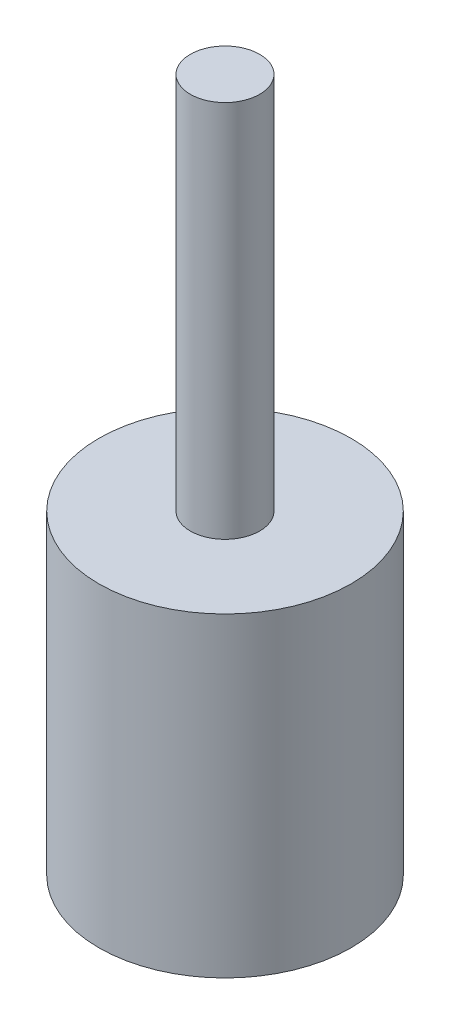
ISO-10303-21;
HEADER;
FILE_DESCRIPTION(('STEP AP214'),'2;1');
FILE_NAME('part.step','',(''),(''),'','','');
FILE_SCHEMA(('AUTOMOTIVE_DESIGN { 1 0 10303 214 1 1 1 1 }'));
ENDSEC;
DATA;
#1=APPLICATION_CONTEXT('core data for automotive mechanical design processes');
#2=APPLICATION_PROTOCOL_DEFINITION('international standard','automotive_design',2000,#1);
#3=PRODUCT_CONTEXT('',#1,'mechanical');
#4=PRODUCT('Part','Part','',(#3));
#5=PRODUCT_RELATED_PRODUCT_CATEGORY('part','',(#4));
#6=PRODUCT_DEFINITION_FORMATION('','',#4);
#7=PRODUCT_DEFINITION_CONTEXT('part definition',#1,'design');
#8=PRODUCT_DEFINITION('design','',#6,#7);
#9=PRODUCT_DEFINITION_SHAPE('','',#8);
#10=(LENGTH_UNIT() NAMED_UNIT(*) SI_UNIT(.MILLI.,.METRE.));
#11=(NAMED_UNIT(*) PLANE_ANGLE_UNIT() SI_UNIT($,.RADIAN.));
#12=(NAMED_UNIT(*) SI_UNIT($,.STERADIAN.) SOLID_ANGLE_UNIT());
#13=UNCERTAINTY_MEASURE_WITH_UNIT(LENGTH_MEASURE(1.E-05),#10,'distance_accuracy_value','');
#14=(GEOMETRIC_REPRESENTATION_CONTEXT(3) GLOBAL_UNCERTAINTY_ASSIGNED_CONTEXT((#13)) GLOBAL_UNIT_ASSIGNED_CONTEXT((#10,
#11,#12)) REPRESENTATION_CONTEXT('',''));
#15=CARTESIAN_POINT('',(0.,0.,0.));
#16=DIRECTION('',(0.,0.,1.));
#17=DIRECTION('',(1.,0.,0.));
#18=AXIS2_PLACEMENT_3D('',#15,#16,#17);
#19=CARTESIAN_POINT('',(0.,100.,0.));
#20=DIRECTION('',(0.,1.,0.));
#21=DIRECTION('',(0.,0.,1.00000000000001));
#22=AXIS2_PLACEMENT_3D('',#19,#20,#21);
#23=PLANE('',#22);
#24=CARTESIAN_POINT('',(0.,100.,0.));
#25=DIRECTION('',(0.,1.,0.));
#26=DIRECTION('',(0.,0.,1.00000000000001));
#27=AXIS2_PLACEMENT_3D('',#24,#25,#26);
#28=CIRCLE('',#27,11.);
#29=CARTESIAN_POINT('',(0.,100.,11.0000000000001));
#30=VERTEX_POINT('',#29);
#31=EDGE_CURVE('E12',#30,#30,#28,.T.);
#32=ORIENTED_EDGE('',*,*,#31,.F.);
#33=EDGE_LOOP('',(#32));
#34=FACE_BOUND('',#33,.T.);
#35=CARTESIAN_POINT('',(0.,100.,0.));
#36=DIRECTION('',(0.,-1.,0.));
#37=DIRECTION('',(0.,0.,-1.00000000000001));
#38=AXIS2_PLACEMENT_3D('',#35,#36,#37);
#39=CIRCLE('',#38,40.);
#40=CARTESIAN_POINT('',(0.,100.,-40.0000000000004));
#41=VERTEX_POINT('',#40);
#42=EDGE_CURVE('E52',#41,#41,#39,.T.);
#43=ORIENTED_EDGE('',*,*,#42,.F.);
#44=EDGE_LOOP('',(#43));
#45=FACE_BOUND('',#44,.T.);
#46=ADVANCED_FACE('F46',(#34,#45),#23,.T.);
#47=CARTESIAN_POINT('',(0.,0.,0.));
#48=DIRECTION('',(0.,-1.,0.));
#49=DIRECTION('',(0.,0.,-1.00000000000001));
#50=AXIS2_PLACEMENT_3D('',#47,#48,#49);
#51=CYLINDRICAL_SURFACE('',#50,40.);
#52=ORIENTED_EDGE('',*,*,#42,.T.);
#53=EDGE_LOOP('',(#52));
#54=FACE_BOUND('',#53,.T.);
#55=CARTESIAN_POINT('',(0.,0.,0.));
#56=DIRECTION('',(0.,-1.,0.));
#57=DIRECTION('',(0.,0.,-1.00000000000001));
#58=AXIS2_PLACEMENT_3D('',#55,#56,#57);
#59=CIRCLE('',#58,40.);
#60=CARTESIAN_POINT('',(0.,0.,-40.0000000000004));
#61=VERTEX_POINT('',#60);
#62=EDGE_CURVE('E56',#61,#61,#59,.T.);
#63=ORIENTED_EDGE('',*,*,#62,.F.);
#64=EDGE_LOOP('',(#63));
#65=FACE_BOUND('',#64,.T.);
#66=ADVANCED_FACE('F77',(#54,#65),#51,.T.);
#67=CARTESIAN_POINT('',(40.0000000000001,0.,0.));
#68=DIRECTION('',(0.,-1.,0.));
#69=DIRECTION('',(0.,0.,-1.00000000000001));
#70=AXIS2_PLACEMENT_3D('',#67,#68,#69);
#71=PLANE('',#70);
#72=ORIENTED_EDGE('',*,*,#62,.T.);
#73=EDGE_LOOP('',(#72));
#74=FACE_BOUND('',#73,.T.);
#75=ADVANCED_FACE('F70',(#74),#71,.T.);
#76=CARTESIAN_POINT('',(0.,220.,0.));
#77=DIRECTION('',(0.,1.,0.));
#78=DIRECTION('',(0.,0.,1.00000000000001));
#79=AXIS2_PLACEMENT_3D('',#76,#77,#78);
#80=PLANE('',#79);
#81=CARTESIAN_POINT('',(0.,220.,0.));
#82=DIRECTION('',(0.,-1.,0.));
#83=DIRECTION('',(0.,0.,-1.00000000000001));
#84=AXIS2_PLACEMENT_3D('',#81,#82,#83);
#85=CIRCLE('',#84,11.);
#86=CARTESIAN_POINT('',(0.,220.,-11.0000000000001));
#87=VERTEX_POINT('',#86);
#88=EDGE_CURVE('E60',#87,#87,#85,.T.);
#89=ORIENTED_EDGE('',*,*,#88,.F.);
#90=EDGE_LOOP('',(#89));
#91=FACE_BOUND('',#90,.T.);
#92=ADVANCED_FACE('F68',(#91),#80,.T.);
#93=CARTESIAN_POINT('',(0.,100.,0.));
#94=DIRECTION('',(0.,-1.,0.));
#95=DIRECTION('',(0.,0.,-1.00000000000001));
#96=AXIS2_PLACEMENT_3D('',#93,#94,#95);
#97=CYLINDRICAL_SURFACE('',#96,11.);
#98=ORIENTED_EDGE('',*,*,#88,.T.);
#99=EDGE_LOOP('',(#98));
#100=FACE_BOUND('',#99,.T.);
#101=ORIENTED_EDGE('',*,*,#31,.T.);
#102=EDGE_LOOP('',(#101));
#103=FACE_BOUND('',#102,.T.);
#104=ADVANCED_FACE('F66',(#100,#103),#97,.T.);
#105=CLOSED_SHELL('',(#46,#66,#75,#92,#104));
#106=MANIFOLD_SOLID_BREP('B2',#105);
#107=ADVANCED_BREP_SHAPE_REPRESENTATION('',(#18,#106),#14);
#108=SHAPE_DEFINITION_REPRESENTATION(#9,#107);
ENDSEC;
END-ISO-10303-21;
